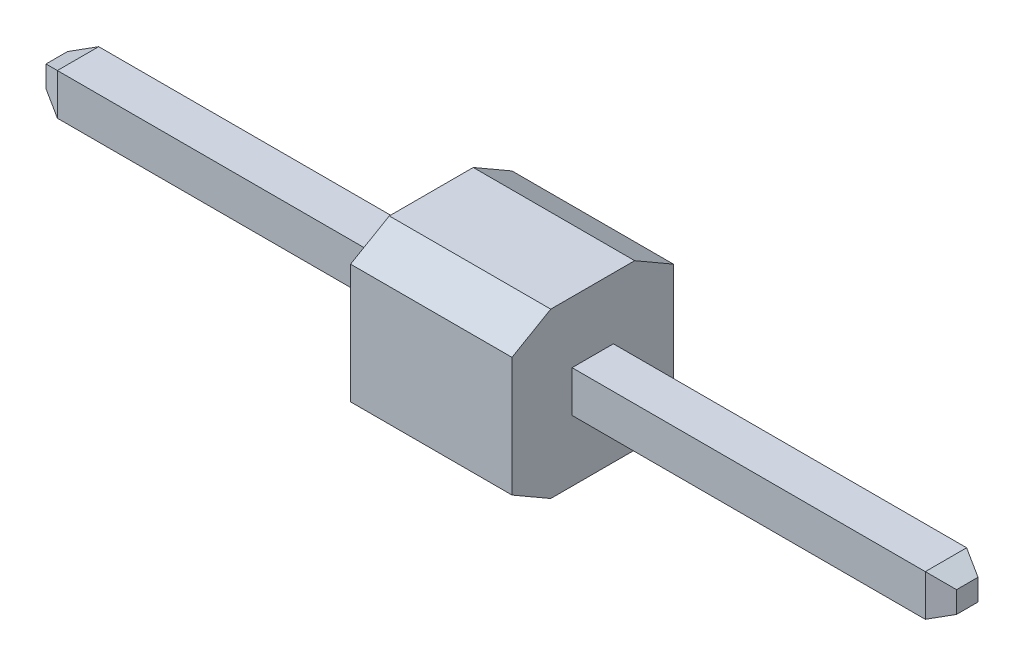
ISO-10303-21;
HEADER;
FILE_DESCRIPTION(('STEP AP214'),'2;1');
FILE_NAME('part.step','',(''),(''),'','','');
FILE_SCHEMA(('AUTOMOTIVE_DESIGN { 1 0 10303 214 1 1 1 1 }'));
ENDSEC;
DATA;
#1=APPLICATION_CONTEXT('core data for automotive mechanical design processes');
#2=APPLICATION_PROTOCOL_DEFINITION('international standard','automotive_design',2000,#1);
#3=PRODUCT_CONTEXT('',#1,'mechanical');
#4=PRODUCT('Part','Part','',(#3));
#5=PRODUCT_RELATED_PRODUCT_CATEGORY('part','',(#4));
#6=PRODUCT_DEFINITION_FORMATION('','',#4);
#7=PRODUCT_DEFINITION_CONTEXT('part definition',#1,'design');
#8=PRODUCT_DEFINITION('design','',#6,#7);
#9=PRODUCT_DEFINITION_SHAPE('','',#8);
#10=(LENGTH_UNIT() NAMED_UNIT(*) SI_UNIT(.MILLI.,.METRE.));
#11=(NAMED_UNIT(*) PLANE_ANGLE_UNIT() SI_UNIT($,.RADIAN.));
#12=(NAMED_UNIT(*) SI_UNIT($,.STERADIAN.) SOLID_ANGLE_UNIT());
#13=UNCERTAINTY_MEASURE_WITH_UNIT(LENGTH_MEASURE(1.E-05),#10,'distance_accuracy_value','');
#14=(GEOMETRIC_REPRESENTATION_CONTEXT(3) GLOBAL_UNCERTAINTY_ASSIGNED_CONTEXT((#13)) GLOBAL_UNIT_ASSIGNED_CONTEXT((#10,
#11,#12)) REPRESENTATION_CONTEXT('',''));
#15=CARTESIAN_POINT('',(0.,0.,0.));
#16=DIRECTION('',(0.,0.,1.));
#17=DIRECTION('',(1.,0.,0.));
#18=AXIS2_PLACEMENT_3D('',#15,#16,#17);
#19=CARTESIAN_POINT('',(5.42105081617534,-15.5571282629139,0.629998634255617));
#20=DIRECTION('',(1.,4.37113882867379E-08,-4.37113882867379E-08));
#21=DIRECTION('',(-4.37113882867379E-08,1.,0.));
#22=AXIS2_PLACEMENT_3D('',#19,#20,#21);
#23=PLANE('',#22);
#24=DIRECTION('',(1.59994777304464E-08,0.500000000000191,0.866025403784328));
#25=VECTOR('',#24,1.);
#26=CARTESIAN_POINT('',(5.42105069318942,-14.3135384244239,-0.940001365744382));
#27=LINE('',#26,#25);
#28=CARTESIAN_POINT('',(5.42105069318942,-14.3135384244239,-0.940001365744382));
#29=VERTEX_POINT('',#28);
#30=CARTESIAN_POINT('',(5.42105070427419,-13.9671282629139,-0.340001365744383));
#31=VERTEX_POINT('',#30);
#32=EDGE_CURVE('E11',#29,#31,#27,.T.);
#33=ORIENTED_EDGE('',*,*,#32,.T.);
#34=DIRECTION('',(4.37113880134522E-08,0.,0.999999999999999));
#35=VECTOR('',#34,1.);
#36=CARTESIAN_POINT('',(5.42105070427419,-13.9671282629139,-0.340001365744383));
#37=LINE('',#36,#35);
#38=CARTESIAN_POINT('',(5.42105076109899,-13.9671282629139,0.959998634255618));
#39=VERTEX_POINT('',#38);
#40=EDGE_CURVE('E304',#31,#39,#37,.T.);
#41=ORIENTED_EDGE('',*,*,#40,.T.);
#42=DIRECTION('',(5.97108681645513E-08,-0.500000000000186,0.866025403784329));
#43=VECTOR('',#42,1.);
#44=CARTESIAN_POINT('',(5.42105076109899,-13.9671282629139,0.959998634255618));
#45=LINE('',#44,#43);
#46=CARTESIAN_POINT('',(5.42105080246789,-14.3135384244239,1.55999863425562));
#47=VERTEX_POINT('',#46);
#48=EDGE_CURVE('E296',#39,#47,#45,.T.);
#49=ORIENTED_EDGE('',*,*,#48,.T.);
#50=DIRECTION('',(4.37113880007249E-08,-0.999999999999999,0.));
#51=VECTOR('',#50,1.);
#52=CARTESIAN_POINT('',(5.42105080246789,-14.3135384244239,1.55999863425562));
#53=LINE('',#52,#51);
#54=CARTESIAN_POINT('',(5.42105088321068,-16.1607181013939,1.55999863425562));
#55=VERTEX_POINT('',#54);
#56=EDGE_CURVE('E281',#47,#55,#53,.T.);
#57=ORIENTED_EDGE('',*,*,#56,.T.);
#58=DIRECTION('',(1.59994790123059E-08,0.500000000000195,0.866025403784326));
#59=VECTOR('',#58,1.);
#60=CARTESIAN_POINT('',(5.42105087212592,-16.5071282629139,0.959998634255618));
#61=LINE('',#60,#59);
#62=CARTESIAN_POINT('',(5.42105087212592,-16.5071282629139,0.959998634255618));
#63=VERTEX_POINT('',#62);
#64=EDGE_CURVE('E265',#63,#55,#61,.T.);
#65=ORIENTED_EDGE('',*,*,#64,.F.);
#66=DIRECTION('',(4.37113880134522E-08,0.,0.999999999999999));
#67=VECTOR('',#66,1.);
#68=CARTESIAN_POINT('',(5.42105081530111,-16.5071282629139,-0.340001365744383));
#69=LINE('',#68,#67);
#70=CARTESIAN_POINT('',(5.42105081530111,-16.5071282629139,-0.340001365744383));
#71=VERTEX_POINT('',#70);
#72=EDGE_CURVE('E248',#71,#63,#69,.T.);
#73=ORIENTED_EDGE('',*,*,#72,.F.);
#74=DIRECTION('',(5.97108668821451E-08,-0.500000000000186,0.866025403784329));
#75=VECTOR('',#74,1.);
#76=CARTESIAN_POINT('',(5.42105077393221,-16.1607181013939,-0.940001365744382));
#77=LINE('',#76,#75);
#78=CARTESIAN_POINT('',(5.42105077393221,-16.1607181013939,-0.940001365744382));
#79=VERTEX_POINT('',#78);
#80=EDGE_CURVE('E242',#79,#71,#77,.T.);
#81=ORIENTED_EDGE('',*,*,#80,.F.);
#82=DIRECTION('',(4.37113880007249E-08,-0.999999999999999,0.));
#83=VECTOR('',#82,1.);
#84=CARTESIAN_POINT('',(5.42105069318942,-14.3135384244239,-0.940001365744382));
#85=LINE('',#84,#83);
#86=EDGE_CURVE('E236',#29,#79,#85,.T.);
#87=ORIENTED_EDGE('',*,*,#86,.F.);
#88=EDGE_LOOP('',(#33,#41,#49,#57,#65,#73,#81,#87));
#89=FACE_BOUND('',#88,.T.);
#90=DIRECTION('',(-4.37113872875372E-08,0.,-0.999999999999999));
#91=VECTOR('',#90,1.);
#92=CARTESIAN_POINT('',(5.42105078820005,-14.9171282629139,0.629998634255617));
#93=LINE('',#92,#91);
#94=CARTESIAN_POINT('',(5.42105078820005,-14.9171282629139,0.629998634255617));
#95=VERTEX_POINT('',#94);
#96=CARTESIAN_POINT('',(5.42105076022476,-14.9171282629139,-0.0100013657443826));
#97=VERTEX_POINT('',#96);
#98=EDGE_CURVE('E302',#95,#97,#93,.T.);
#99=ORIENTED_EDGE('',*,*,#98,.T.);
#100=DIRECTION('',(-4.37113872875371E-08,0.999999999999999,0.));
#101=VECTOR('',#100,1.);
#102=CARTESIAN_POINT('',(5.42105078820005,-15.5571282629139,-0.0100013657443826));
#103=LINE('',#102,#101);
#104=CARTESIAN_POINT('',(5.42105078820005,-15.5571282629139,-0.0100013657443826));
#105=VERTEX_POINT('',#104);
#106=EDGE_CURVE('E293',#105,#97,#103,.T.);
#107=ORIENTED_EDGE('',*,*,#106,.F.);
#108=DIRECTION('',(-4.37113886753159E-08,0.,-0.999999999999999));
#109=VECTOR('',#108,1.);
#110=CARTESIAN_POINT('',(5.42105081617534,-15.5571282629139,0.629998634255617));
#111=LINE('',#110,#109);
#112=CARTESIAN_POINT('',(5.42105081617534,-15.5571282629139,0.629998634255617));
#113=VERTEX_POINT('',#112);
#114=EDGE_CURVE('E278',#113,#105,#111,.T.);
#115=ORIENTED_EDGE('',*,*,#114,.F.);
#116=DIRECTION('',(-4.37113886753159E-08,0.999999999999999,0.));
#117=VECTOR('',#116,1.);
#118=CARTESIAN_POINT('',(5.42105081617534,-15.5571282629139,0.629998634255617));
#119=LINE('',#118,#117);
#120=EDGE_CURVE('E263',#113,#95,#119,.T.);
#121=ORIENTED_EDGE('',*,*,#120,.T.);
#122=EDGE_LOOP('',(#99,#107,#115,#121));
#123=FACE_BOUND('',#122,.T.);
#124=ADVANCED_FACE('F17',(#89,#123),#23,.T.);
#125=CARTESIAN_POINT('',(2.92105081617534,-15.5571283721924,0.629998743534088));
#126=DIRECTION('',(1.,4.37113882867379E-08,-4.37113882867379E-08));
#127=DIRECTION('',(-4.37113882867379E-08,1.,0.));
#128=AXIS2_PLACEMENT_3D('',#125,#126,#127);
#129=PLANE('',#128);
#130=DIRECTION('',(1.59994783714339E-08,0.500000000000191,0.866025403784328));
#131=VECTOR('',#130,1.);
#132=CARTESIAN_POINT('',(2.92105069318942,-14.3135385337024,-0.940001256465912));
#133=LINE('',#132,#131);
#134=CARTESIAN_POINT('',(2.92105069318942,-14.3135385337024,-0.940001256465912));
#135=VERTEX_POINT('',#134);
#136=CARTESIAN_POINT('',(2.92105070427419,-13.9671283721924,-0.340001256465912));
#137=VERTEX_POINT('',#136);
#138=EDGE_CURVE('E24',#135,#137,#133,.T.);
#139=ORIENTED_EDGE('',*,*,#138,.F.);
#140=DIRECTION('',(4.37113882411396E-08,-0.999999999999999,0.));
#141=VECTOR('',#140,1.);
#142=CARTESIAN_POINT('',(2.92105069318942,-14.3135385337024,-0.940001256465912));
#143=LINE('',#142,#141);
#144=CARTESIAN_POINT('',(2.92105077393221,-16.1607182106724,-0.940001256465912));
#145=VERTEX_POINT('',#144);
#146=EDGE_CURVE('E300',#135,#145,#143,.T.);
#147=ORIENTED_EDGE('',*,*,#146,.T.);
#148=DIRECTION('',(5.97108668821451E-08,-0.500000000000186,0.866025403784329));
#149=VECTOR('',#148,1.);
#150=CARTESIAN_POINT('',(2.92105077393221,-16.1607182106724,-0.940001256465912));
#151=LINE('',#150,#149);
#152=CARTESIAN_POINT('',(2.92105081530111,-16.5071283721924,-0.340001256465912));
#153=VERTEX_POINT('',#152);
#154=EDGE_CURVE('E286',#145,#153,#151,.T.);
#155=ORIENTED_EDGE('',*,*,#154,.T.);
#156=DIRECTION('',(4.37113883550593E-08,0.,0.999999999999999));
#157=VECTOR('',#156,1.);
#158=CARTESIAN_POINT('',(2.92105081530111,-16.5071283721924,-0.340001256465912));
#159=LINE('',#158,#157);
#160=CARTESIAN_POINT('',(2.92105087212592,-16.5071283721924,0.959998743534088));
#161=VERTEX_POINT('',#160);
#162=EDGE_CURVE('E271',#153,#161,#159,.T.);
#163=ORIENTED_EDGE('',*,*,#162,.T.);
#164=DIRECTION('',(1.59994783713184E-08,0.500000000000195,0.866025403784326));
#165=VECTOR('',#164,1.);
#166=CARTESIAN_POINT('',(2.92105087212592,-16.5071283721924,0.959998743534088));
#167=LINE('',#166,#165);
#168=CARTESIAN_POINT('',(2.92105088321068,-16.1607182106724,1.55999874353409));
#169=VERTEX_POINT('',#168);
#170=EDGE_CURVE('E253',#161,#169,#167,.T.);
#171=ORIENTED_EDGE('',*,*,#170,.T.);
#172=DIRECTION('',(4.37113882411396E-08,-0.999999999999999,0.));
#173=VECTOR('',#172,1.);
#174=CARTESIAN_POINT('',(2.92105080246789,-14.3135385337024,1.55999874353409));
#175=LINE('',#174,#173);
#176=CARTESIAN_POINT('',(2.92105080246789,-14.3135385337024,1.55999874353409));
#177=VERTEX_POINT('',#176);
#178=EDGE_CURVE('E261',#177,#169,#175,.T.);
#179=ORIENTED_EDGE('',*,*,#178,.F.);
#180=DIRECTION('',(5.97108668825762E-08,-0.500000000000186,0.866025403784329));
#181=VECTOR('',#180,1.);
#182=CARTESIAN_POINT('',(2.92105076109899,-13.9671283721924,0.959998743534088));
#183=LINE('',#182,#181);
#184=CARTESIAN_POINT('',(2.92105076109899,-13.9671283721924,0.959998743534088));
#185=VERTEX_POINT('',#184);
#186=EDGE_CURVE('E276',#185,#177,#183,.T.);
#187=ORIENTED_EDGE('',*,*,#186,.F.);
#188=DIRECTION('',(4.37113883550593E-08,0.,0.999999999999999));
#189=VECTOR('',#188,1.);
#190=CARTESIAN_POINT('',(2.92105070427419,-13.9671283721924,-0.340001256465912));
#191=LINE('',#190,#189);
#192=EDGE_CURVE('E291',#137,#185,#191,.T.);
#193=ORIENTED_EDGE('',*,*,#192,.F.);
#194=EDGE_LOOP('',(#139,#147,#155,#163,#171,#179,#187,#193));
#195=FACE_BOUND('',#194,.T.);
#196=DIRECTION('',(-4.37113886753159E-08,0.999999999999999,0.));
#197=VECTOR('',#196,1.);
#198=CARTESIAN_POINT('',(2.92105078820005,-15.5571283721924,-0.0100012564659119));
#199=LINE('',#198,#197);
#200=CARTESIAN_POINT('',(2.92105078820005,-15.5571283721924,-0.0100012564659119));
#201=VERTEX_POINT('',#200);
#202=CARTESIAN_POINT('',(2.92105076022476,-14.9171283721924,-0.0100012564659119));
#203=VERTEX_POINT('',#202);
#204=EDGE_CURVE('E298',#201,#203,#199,.T.);
#205=ORIENTED_EDGE('',*,*,#204,.T.);
#206=DIRECTION('',(-4.37113886753159E-08,0.,-0.999999999999999));
#207=VECTOR('',#206,1.);
#208=CARTESIAN_POINT('',(2.92105078820005,-14.9171283721924,0.629998743534088));
#209=LINE('',#208,#207);
#210=CARTESIAN_POINT('',(2.92105078820005,-14.9171283721924,0.629998743534088));
#211=VERTEX_POINT('',#210);
#212=EDGE_CURVE('E283',#211,#203,#209,.T.);
#213=ORIENTED_EDGE('',*,*,#212,.F.);
#214=DIRECTION('',(-4.37113879814265E-08,0.999999999999999,0.));
#215=VECTOR('',#214,1.);
#216=CARTESIAN_POINT('',(2.92105081617534,-15.5571283721924,0.629998743534088));
#217=LINE('',#216,#215);
#218=CARTESIAN_POINT('',(2.92105081617534,-15.5571283721924,0.629998743534088));
#219=VERTEX_POINT('',#218);
#220=EDGE_CURVE('E268',#219,#211,#217,.T.);
#221=ORIENTED_EDGE('',*,*,#220,.F.);
#222=DIRECTION('',(-4.37113879814266E-08,0.,-0.999999999999999));
#223=VECTOR('',#222,1.);
#224=CARTESIAN_POINT('',(2.92105081617534,-15.5571283721924,0.629998743534088));
#225=LINE('',#224,#223);
#226=EDGE_CURVE('E251',#219,#201,#225,.T.);
#227=ORIENTED_EDGE('',*,*,#226,.T.);
#228=EDGE_LOOP('',(#205,#213,#221,#227));
#229=FACE_BOUND('',#228,.T.);
#230=ADVANCED_FACE('F314',(#195,#229),#129,.F.);
#231=CARTESIAN_POINT('',(5.42105069318942,-14.3135384244239,-0.940001365744382));
#232=DIRECTION('',(5.97108668343731E-08,-0.866025403784328,0.50000000000019));
#233=DIRECTION('',(-1.59994785476185E-08,-0.500000000000192,-0.866025403784329));
#234=AXIS2_PLACEMENT_3D('',#231,#232,#233);
#235=PLANE('',#234);
#236=ORIENTED_EDGE('',*,*,#138,.T.);
#237=DIRECTION('',(-0.999999999999998,-4.37113854445669E-08,4.37113883755557E-08));
#238=VECTOR('',#237,1.);
#239=CARTESIAN_POINT('',(5.42105070427419,-13.9671282629139,-0.340001365744383));
#240=LINE('',#239,#238);
#241=EDGE_CURVE('E288',#31,#137,#240,.T.);
#242=ORIENTED_EDGE('',*,*,#241,.F.);
#243=ORIENTED_EDGE('',*,*,#32,.F.);
#244=DIRECTION('',(-0.999999999999998,-4.37113897078233E-08,4.37113881091021E-08));
#245=VECTOR('',#244,1.);
#246=CARTESIAN_POINT('',(5.42105069318942,-14.3135384244239,-0.940001365744382));
#247=LINE('',#246,#245);
#248=EDGE_CURVE('E256',#29,#135,#247,.T.);
#249=ORIENTED_EDGE('',*,*,#248,.T.);
#250=EDGE_LOOP('',(#236,#242,#243,#249));
#251=FACE_BOUND('',#250,.T.);
#252=ADVANCED_FACE('F306',(#251),#235,.F.);
#253=CARTESIAN_POINT('',(5.42105070427419,-13.9671282629139,-0.340001365744383));
#254=DIRECTION('',(4.37113882867379E-08,-1.,0.));
#255=DIRECTION('',(1.,4.37113882867379E-08,-4.37113882867379E-08));
#256=AXIS2_PLACEMENT_3D('',#253,#254,#255);
#257=PLANE('',#256);
#258=ORIENTED_EDGE('',*,*,#192,.T.);
#259=DIRECTION('',(-0.999999999999998,-4.37113854445669E-08,4.37113882867378E-08));
#260=VECTOR('',#259,1.);
#261=CARTESIAN_POINT('',(5.42105076109899,-13.9671282629139,0.959998634255618));
#262=LINE('',#261,#260);
#263=EDGE_CURVE('E273',#39,#185,#262,.T.);
#264=ORIENTED_EDGE('',*,*,#263,.F.);
#265=ORIENTED_EDGE('',*,*,#40,.F.);
#266=ORIENTED_EDGE('',*,*,#241,.T.);
#267=EDGE_LOOP('',(#258,#264,#265,#266));
#268=FACE_BOUND('',#267,.T.);
#269=ADVANCED_FACE('F311',(#268),#257,.F.);
#270=CARTESIAN_POINT('',(5.42105076109899,-13.9671282629139,0.959998634255618));
#271=DIRECTION('',(1.59994785476185E-08,-0.86602540378433,-0.50000000000019));
#272=DIRECTION('',(-5.97108668343731E-08,0.500000000000188,-0.866025403784329));
#273=AXIS2_PLACEMENT_3D('',#270,#271,#272);
#274=PLANE('',#273);
#275=ORIENTED_EDGE('',*,*,#186,.T.);
#276=DIRECTION('',(-0.999999999999998,-4.37113897078233E-08,4.37113882867378E-08));
#277=VECTOR('',#276,1.);
#278=CARTESIAN_POINT('',(5.42105080246789,-14.3135384244239,1.55999863425562));
#279=LINE('',#278,#277);
#280=EDGE_CURVE('E258',#47,#177,#279,.T.);
#281=ORIENTED_EDGE('',*,*,#280,.F.);
#282=ORIENTED_EDGE('',*,*,#48,.F.);
#283=ORIENTED_EDGE('',*,*,#263,.T.);
#284=EDGE_LOOP('',(#275,#281,#282,#283));
#285=FACE_BOUND('',#284,.T.);
#286=ADVANCED_FACE('F319',(#285),#274,.F.);
#287=CARTESIAN_POINT('',(5.42105080246789,-14.3135384244239,1.55999863425562));
#288=DIRECTION('',(-4.37113882867379E-08,0.,-1.));
#289=DIRECTION('',(-1.,-4.37113882867379E-08,4.37113882867379E-08));
#290=AXIS2_PLACEMENT_3D('',#287,#288,#289);
#291=PLANE('',#290);
#292=ORIENTED_EDGE('',*,*,#178,.T.);
#293=DIRECTION('',(-0.999999999999998,-4.37113897078233E-08,4.37113882867378E-08));
#294=VECTOR('',#293,1.);
#295=CARTESIAN_POINT('',(5.42105088321068,-16.1607181013939,1.55999863425562));
#296=LINE('',#295,#294);
#297=EDGE_CURVE('E245',#55,#169,#296,.T.);
#298=ORIENTED_EDGE('',*,*,#297,.F.);
#299=ORIENTED_EDGE('',*,*,#56,.F.);
#300=ORIENTED_EDGE('',*,*,#280,.T.);
#301=EDGE_LOOP('',(#292,#298,#299,#300));
#302=FACE_BOUND('',#301,.T.);
#303=ADVANCED_FACE('F326',(#302),#291,.F.);
#304=CARTESIAN_POINT('',(5.42105087212592,-16.5071282629139,0.959998634255618));
#305=DIRECTION('',(5.97108668343731E-08,-0.866025403784328,0.50000000000019));
#306=DIRECTION('',(-1.59994785476185E-08,-0.500000000000192,-0.866025403784329));
#307=AXIS2_PLACEMENT_3D('',#304,#305,#306);
#308=PLANE('',#307);
#309=ORIENTED_EDGE('',*,*,#170,.F.);
#310=DIRECTION('',(-0.999999999999998,-4.37113854445669E-08,4.37113882867378E-08));
#311=VECTOR('',#310,1.);
#312=CARTESIAN_POINT('',(5.42105087212592,-16.5071282629139,0.959998634255618));
#313=LINE('',#312,#311);
#314=EDGE_CURVE('E239',#63,#161,#313,.T.);
#315=ORIENTED_EDGE('',*,*,#314,.F.);
#316=ORIENTED_EDGE('',*,*,#64,.T.);
#317=ORIENTED_EDGE('',*,*,#297,.T.);
#318=EDGE_LOOP('',(#309,#315,#316,#317));
#319=FACE_BOUND('',#318,.T.);
#320=ADVANCED_FACE('F329',(#319),#308,.T.);
#321=CARTESIAN_POINT('',(5.42105081530111,-16.5071282629139,-0.340001365744383));
#322=DIRECTION('',(4.37113882867379E-08,-1.,0.));
#323=DIRECTION('',(1.,4.37113882867379E-08,-4.37113882867379E-08));
#324=AXIS2_PLACEMENT_3D('',#321,#322,#323);
#325=PLANE('',#324);
#326=ORIENTED_EDGE('',*,*,#162,.F.);
#327=DIRECTION('',(-0.999999999999998,-4.37113854445669E-08,4.37113883755557E-08));
#328=VECTOR('',#327,1.);
#329=CARTESIAN_POINT('',(5.42105081530111,-16.5071282629139,-0.340001365744383));
#330=LINE('',#329,#328);
#331=EDGE_CURVE('E233',#71,#153,#330,.T.);
#332=ORIENTED_EDGE('',*,*,#331,.F.);
#333=ORIENTED_EDGE('',*,*,#72,.T.);
#334=ORIENTED_EDGE('',*,*,#314,.T.);
#335=EDGE_LOOP('',(#326,#332,#333,#334));
#336=FACE_BOUND('',#335,.T.);
#337=ADVANCED_FACE('F333',(#336),#325,.T.);
#338=CARTESIAN_POINT('',(5.42105077393221,-16.1607181013939,-0.940001365744382));
#339=DIRECTION('',(1.59994785476185E-08,-0.86602540378433,-0.50000000000019));
#340=DIRECTION('',(-5.97108668343731E-08,0.500000000000188,-0.866025403784329));
#341=AXIS2_PLACEMENT_3D('',#338,#339,#340);
#342=PLANE('',#341);
#343=ORIENTED_EDGE('',*,*,#154,.F.);
#344=DIRECTION('',(-0.999999999999998,-4.37113897078233E-08,4.37113881091022E-08));
#345=VECTOR('',#344,1.);
#346=CARTESIAN_POINT('',(5.42105077393221,-16.1607181013939,-0.940001365744382));
#347=LINE('',#346,#345);
#348=EDGE_CURVE('E230',#79,#145,#347,.T.);
#349=ORIENTED_EDGE('',*,*,#348,.F.);
#350=ORIENTED_EDGE('',*,*,#80,.T.);
#351=ORIENTED_EDGE('',*,*,#331,.T.);
#352=EDGE_LOOP('',(#343,#349,#350,#351));
#353=FACE_BOUND('',#352,.T.);
#354=ADVANCED_FACE('F337',(#353),#342,.T.);
#355=CARTESIAN_POINT('',(5.42105069318942,-14.3135384244239,-0.940001365744382));
#356=DIRECTION('',(-4.37113882867379E-08,0.,-1.));
#357=DIRECTION('',(-4.37113882867379E-08,1.,0.));
#358=AXIS2_PLACEMENT_3D('',#355,#356,#357);
#359=PLANE('',#358);
#360=ORIENTED_EDGE('',*,*,#146,.F.);
#361=ORIENTED_EDGE('',*,*,#248,.F.);
#362=ORIENTED_EDGE('',*,*,#86,.T.);
#363=ORIENTED_EDGE('',*,*,#348,.T.);
#364=EDGE_LOOP('',(#360,#361,#362,#363));
#365=FACE_BOUND('',#364,.T.);
#366=ADVANCED_FACE('F339',(#365),#359,.T.);
#367=CARTESIAN_POINT('',(-2.87894918382466,-15.5571286257184,0.62999899706014));
#368=DIRECTION('',(-1.,-4.37113882867379E-08,4.37113882867379E-08));
#369=DIRECTION('',(4.37113882867379E-08,-1.,0.));
#370=AXIS2_PLACEMENT_3D('',#367,#368,#369);
#371=PLANE('',#370);
#372=DIRECTION('',(4.3711384729096E-08,-0.999999999999999,0.));
#373=VECTOR('',#372,1.);
#374=CARTESIAN_POINT('',(-2.87894922632249,-15.0710101529084,0.14388052425114));
#375=LINE('',#374,#373);
#376=CARTESIAN_POINT('',(-2.87894922632249,-15.0710101529084,0.14388052425114));
#377=VERTEX_POINT('',#376);
#378=CARTESIAN_POINT('',(-2.87894921179995,-15.4032470985184,0.14388052425114));
#379=VERTEX_POINT('',#378);
#380=EDGE_CURVE('E228',#377,#379,#375,.T.);
#381=ORIENTED_EDGE('',*,*,#380,.T.);
#382=DIRECTION('',(4.37113900746999E-08,0.,0.999999999999999));
#383=VECTOR('',#382,1.);
#384=CARTESIAN_POINT('',(-2.87894921179995,-15.4032470985184,0.14388052425114));
#385=LINE('',#384,#383);
#386=CARTESIAN_POINT('',(-2.87894919727741,-15.4032470985184,0.47611746986914));
#387=VERTEX_POINT('',#386);
#388=EDGE_CURVE('E223',#379,#387,#385,.T.);
#389=ORIENTED_EDGE('',*,*,#388,.T.);
#390=DIRECTION('',(-4.37113874024243E-08,0.999999999999999,0.));
#391=VECTOR('',#390,1.);
#392=CARTESIAN_POINT('',(-2.87894919727741,-15.4032470985184,0.47611746986914));
#393=LINE('',#392,#391);
#394=CARTESIAN_POINT('',(-2.87894921179995,-15.0710101529084,0.47611746986914));
#395=VERTEX_POINT('',#394);
#396=EDGE_CURVE('E215',#387,#395,#393,.T.);
#397=ORIENTED_EDGE('',*,*,#396,.T.);
#398=DIRECTION('',(-4.37113820547151E-08,0.,-0.999999999999999));
#399=VECTOR('',#398,1.);
#400=CARTESIAN_POINT('',(-2.87894921179995,-15.0710101529084,0.47611746986914));
#401=LINE('',#400,#399);
#402=EDGE_CURVE('E207',#395,#377,#401,.T.);
#403=ORIENTED_EDGE('',*,*,#402,.T.);
#404=EDGE_LOOP('',(#381,#389,#397,#403));
#405=FACE_BOUND('',#404,.T.);
#406=ADVANCED_FACE('F341',(#405),#371,.T.);
#407=CARTESIAN_POINT('',(-2.87894918382466,-15.5571286257184,0.62999899706014));
#408=DIRECTION('',(4.37113882867379E-08,-1.,0.));
#409=DIRECTION('',(-4.37113882867379E-08,0.,-1.));
#410=AXIS2_PLACEMENT_3D('',#407,#408,#409);
#411=PLANE('',#410);
#412=DIRECTION('',(0.999999999999998,4.37113888452998E-08,-4.37113882769955E-08));
#413=VECTOR('',#412,1.);
#414=CARTESIAN_POINT('',(-2.54894918382466,-15.5571286112937,0.629998982635382));
#415=LINE('',#414,#413);
#416=CARTESIAN_POINT('',(-2.54894918382466,-15.5571286112937,0.629998982635382));
#417=VERTEX_POINT('',#416);
#418=EDGE_CURVE('E225',#417,#219,#415,.T.);
#419=ORIENTED_EDGE('',*,*,#418,.F.);
#420=DIRECTION('',(-4.37113886753159E-08,0.,-0.999999999999999));
#421=VECTOR('',#420,1.);
#422=CARTESIAN_POINT('',(-2.54894918382466,-15.5571286112937,0.629998982635382));
#423=LINE('',#422,#421);
#424=CARTESIAN_POINT('',(-2.54894921179995,-15.5571286112937,-0.010001017364618));
#425=VERTEX_POINT('',#424);
#426=EDGE_CURVE('E217',#417,#425,#423,.T.);
#427=ORIENTED_EDGE('',*,*,#426,.T.);
#428=DIRECTION('',(0.999999999999998,4.37113888452998E-08,-4.37113882161057E-08));
#429=VECTOR('',#428,1.);
#430=CARTESIAN_POINT('',(-2.54894921179995,-15.5571286112937,-0.010001017364618));
#431=LINE('',#430,#429);
#432=EDGE_CURVE('E220',#425,#201,#431,.T.);
#433=ORIENTED_EDGE('',*,*,#432,.T.);
#434=ORIENTED_EDGE('',*,*,#226,.F.);
#435=EDGE_LOOP('',(#419,#427,#433,#434));
#436=FACE_BOUND('',#435,.T.);
#437=ADVANCED_FACE('F348',(#436),#411,.T.);
#438=CARTESIAN_POINT('',(-2.87894921179995,-15.5571286257184,-0.0100010029398598));
#439=DIRECTION('',(-4.37113882867379E-08,0.,-1.));
#440=DIRECTION('',(-1.,-4.37113882867379E-08,4.37113882867379E-08));
#441=AXIS2_PLACEMENT_3D('',#438,#439,#440);
#442=PLANE('',#441);
#443=ORIENTED_EDGE('',*,*,#432,.F.);
#444=DIRECTION('',(-4.37113872875371E-08,0.999999999999999,0.));
#445=VECTOR('',#444,1.);
#446=CARTESIAN_POINT('',(-2.54894921179995,-15.5571286112937,-0.010001017364618));
#447=LINE('',#446,#445);
#448=CARTESIAN_POINT('',(-2.54894923977524,-14.9171286112937,-0.010001017364618));
#449=VERTEX_POINT('',#448);
#450=EDGE_CURVE('E209',#425,#449,#447,.T.);
#451=ORIENTED_EDGE('',*,*,#450,.T.);
#452=DIRECTION('',(0.999999999999998,4.37113855978467E-08,-4.37113882161058E-08));
#453=VECTOR('',#452,1.);
#454=CARTESIAN_POINT('',(-2.54894923977524,-14.9171286112937,-0.010001017364618));
#455=LINE('',#454,#453);
#456=EDGE_CURVE('E212',#449,#203,#455,.T.);
#457=ORIENTED_EDGE('',*,*,#456,.T.);
#458=ORIENTED_EDGE('',*,*,#204,.F.);
#459=EDGE_LOOP('',(#443,#451,#457,#458));
#460=FACE_BOUND('',#459,.T.);
#461=ADVANCED_FACE('F424',(#460),#442,.T.);
#462=CARTESIAN_POINT('',(-2.87894921179995,-14.9171286257184,0.62999899706014));
#463=DIRECTION('',(4.37113882867379E-08,-1.,0.));
#464=DIRECTION('',(-4.37113882867379E-08,0.,-1.));
#465=AXIS2_PLACEMENT_3D('',#462,#463,#464);
#466=PLANE('',#465);
#467=ORIENTED_EDGE('',*,*,#456,.F.);
#468=DIRECTION('',(4.37113886753159E-08,0.,0.999999999999999));
#469=VECTOR('',#468,1.);
#470=CARTESIAN_POINT('',(-2.54894923977524,-14.9171286112937,-0.010001017364618));
#471=LINE('',#470,#469);
#472=CARTESIAN_POINT('',(-2.54894921179995,-14.9171286112937,0.629998982635382));
#473=VERTEX_POINT('',#472);
#474=EDGE_CURVE('E201',#449,#473,#471,.T.);
#475=ORIENTED_EDGE('',*,*,#474,.T.);
#476=DIRECTION('',(0.999999999999998,4.37113855978467E-08,-4.37113882769955E-08));
#477=VECTOR('',#476,1.);
#478=CARTESIAN_POINT('',(-2.54894921179995,-14.9171286112937,0.629998982635382));
#479=LINE('',#478,#477);
#480=EDGE_CURVE('E204',#473,#211,#479,.T.);
#481=ORIENTED_EDGE('',*,*,#480,.T.);
#482=ORIENTED_EDGE('',*,*,#212,.T.);
#483=EDGE_LOOP('',(#467,#475,#481,#482));
#484=FACE_BOUND('',#483,.T.);
#485=ADVANCED_FACE('F421',(#484),#466,.F.);
#486=CARTESIAN_POINT('',(-2.87894918382466,-15.5571286257184,0.62999899706014));
#487=DIRECTION('',(-4.37113882867379E-08,0.,-1.));
#488=DIRECTION('',(-1.,-4.37113882867379E-08,4.37113882867379E-08));
#489=AXIS2_PLACEMENT_3D('',#486,#487,#488);
#490=PLANE('',#489);
#491=ORIENTED_EDGE('',*,*,#480,.F.);
#492=DIRECTION('',(4.37113872875371E-08,-0.999999999999999,0.));
#493=VECTOR('',#492,1.);
#494=CARTESIAN_POINT('',(-2.54894921179995,-14.9171286112937,0.629998982635382));
#495=LINE('',#494,#493);
#496=EDGE_CURVE('E196',#473,#417,#495,.T.);
#497=ORIENTED_EDGE('',*,*,#496,.T.);
#498=ORIENTED_EDGE('',*,*,#418,.T.);
#499=ORIENTED_EDGE('',*,*,#220,.T.);
#500=EDGE_LOOP('',(#491,#497,#498,#499));
#501=FACE_BOUND('',#500,.T.);
#502=ADVANCED_FACE('F376',(#501),#490,.F.);
#503=CARTESIAN_POINT('',(-2.87894918382466,-15.5571286257184,0.62999899706014));
#504=DIRECTION('',(-4.37113882867379E-08,0.,-1.));
#505=DIRECTION('',(-1.,-4.37113882867379E-08,4.37113882867379E-08));
#506=AXIS2_PLACEMENT_3D('',#503,#504,#505);
#507=PLANE('',#506);
#508=DIRECTION('',(0.999999999999998,4.37113829998842E-08,-4.37113882769955E-08));
#509=VECTOR('',#508,1.);
#510=CARTESIAN_POINT('',(5.42105081617534,-15.5571282629139,0.629998634255617));
#511=LINE('',#510,#509);
#512=CARTESIAN_POINT('',(10.8910508161753,-15.5571280238126,0.629998395154324));
#513=VERTEX_POINT('',#512);
#514=EDGE_CURVE('E199',#113,#513,#511,.T.);
#515=ORIENTED_EDGE('',*,*,#514,.T.);
#516=DIRECTION('',(-4.37113900630947E-08,0.999999999999999,0.));
#517=VECTOR('',#516,1.);
#518=CARTESIAN_POINT('',(10.8910508161753,-15.5571280238126,0.629998395154324));
#519=LINE('',#518,#517);
#520=CARTESIAN_POINT('',(10.8910507882001,-14.9171280238126,0.629998395154324));
#521=VERTEX_POINT('',#520);
#522=EDGE_CURVE('E191',#513,#521,#519,.T.);
#523=ORIENTED_EDGE('',*,*,#522,.T.);
#524=DIRECTION('',(0.999999999999998,4.37113881958092E-08,-4.37113882769955E-08));
#525=VECTOR('',#524,1.);
#526=CARTESIAN_POINT('',(5.42105078820005,-14.9171282629139,0.629998634255617));
#527=LINE('',#526,#525);
#528=EDGE_CURVE('E194',#95,#521,#527,.T.);
#529=ORIENTED_EDGE('',*,*,#528,.F.);
#530=ORIENTED_EDGE('',*,*,#120,.F.);
#531=EDGE_LOOP('',(#515,#523,#529,#530));
#532=FACE_BOUND('',#531,.T.);
#533=ADVANCED_FACE('F367',(#532),#507,.F.);
#534=CARTESIAN_POINT('',(-2.87894921179995,-14.9171286257184,0.62999899706014));
#535=DIRECTION('',(4.37113882867379E-08,-1.,0.));
#536=DIRECTION('',(-4.37113882867379E-08,0.,-1.));
#537=AXIS2_PLACEMENT_3D('',#534,#535,#536);
#538=PLANE('',#537);
#539=ORIENTED_EDGE('',*,*,#528,.T.);
#540=DIRECTION('',(-4.37113900630947E-08,0.,-0.999999999999999));
#541=VECTOR('',#540,1.);
#542=CARTESIAN_POINT('',(10.8910507882001,-14.9171280238126,0.629998395154324));
#543=LINE('',#542,#541);
#544=CARTESIAN_POINT('',(10.8910507602248,-14.9171280238126,-0.0100016048456765));
#545=VERTEX_POINT('',#544);
#546=EDGE_CURVE('E186',#521,#545,#543,.T.);
#547=ORIENTED_EDGE('',*,*,#546,.T.);
#548=DIRECTION('',(0.999999999999998,4.37113881958092E-08,-4.37113881146228E-08));
#549=VECTOR('',#548,1.);
#550=CARTESIAN_POINT('',(5.42105076022476,-14.9171282629139,-0.0100013657443823));
#551=LINE('',#550,#549);
#552=EDGE_CURVE('E189',#97,#545,#551,.T.);
#553=ORIENTED_EDGE('',*,*,#552,.F.);
#554=ORIENTED_EDGE('',*,*,#98,.F.);
#555=EDGE_LOOP('',(#539,#547,#553,#554));
#556=FACE_BOUND('',#555,.T.);
#557=ADVANCED_FACE('F364',(#556),#538,.F.);
#558=CARTESIAN_POINT('',(-2.87894921179995,-15.5571286257184,-0.0100010029398598));
#559=DIRECTION('',(-4.37113882867379E-08,0.,-1.));
#560=DIRECTION('',(-1.,-4.37113882867379E-08,4.37113882867379E-08));
#561=AXIS2_PLACEMENT_3D('',#558,#559,#560);
#562=PLANE('',#561);
#563=ORIENTED_EDGE('',*,*,#552,.T.);
#564=DIRECTION('',(4.37113900630947E-08,-0.999999999999999,0.));
#565=VECTOR('',#564,1.);
#566=CARTESIAN_POINT('',(10.8910507602248,-14.9171280238126,-0.0100016048456764));
#567=LINE('',#566,#565);
#568=CARTESIAN_POINT('',(10.8910507882001,-15.5571280238126,-0.0100016048456765));
#569=VERTEX_POINT('',#568);
#570=EDGE_CURVE('E176',#545,#569,#567,.T.);
#571=ORIENTED_EDGE('',*,*,#570,.T.);
#572=DIRECTION('',(0.999999999999998,4.37113829998842E-08,-4.37113881146228E-08));
#573=VECTOR('',#572,1.);
#574=CARTESIAN_POINT('',(5.42105078820005,-15.5571282629139,-0.0100013657443823));
#575=LINE('',#574,#573);
#576=EDGE_CURVE('E179',#105,#569,#575,.T.);
#577=ORIENTED_EDGE('',*,*,#576,.F.);
#578=ORIENTED_EDGE('',*,*,#106,.T.);
#579=EDGE_LOOP('',(#563,#571,#577,#578));
#580=FACE_BOUND('',#579,.T.);
#581=ADVANCED_FACE('F366',(#580),#562,.T.);
#582=CARTESIAN_POINT('',(-2.87894918382466,-15.5571286257184,0.62999899706014));
#583=DIRECTION('',(4.37113882867379E-08,-1.,0.));
#584=DIRECTION('',(-4.37113882867379E-08,0.,-1.));
#585=AXIS2_PLACEMENT_3D('',#582,#583,#584);
#586=PLANE('',#585);
#587=ORIENTED_EDGE('',*,*,#576,.T.);
#588=DIRECTION('',(4.37113872875372E-08,0.,0.999999999999999));
#589=VECTOR('',#588,1.);
#590=CARTESIAN_POINT('',(10.8910507882001,-15.5571280238126,-0.0100016048456765));
#591=LINE('',#590,#589);
#592=EDGE_CURVE('E167',#569,#513,#591,.T.);
#593=ORIENTED_EDGE('',*,*,#592,.T.);
#594=ORIENTED_EDGE('',*,*,#514,.F.);
#595=ORIENTED_EDGE('',*,*,#114,.T.);
#596=EDGE_LOOP('',(#587,#593,#594,#595));
#597=FACE_BOUND('',#596,.T.);
#598=ADVANCED_FACE('F373',(#597),#586,.T.);
#599=CARTESIAN_POINT('',(11.2210508161753,-15.5571280093879,0.629998380729565));
#600=DIRECTION('',(-1.,-4.37113882867379E-08,4.37113882867379E-08));
#601=DIRECTION('',(4.37113882867379E-08,-1.,0.));
#602=AXIS2_PLACEMENT_3D('',#599,#600,#601);
#603=PLANE('',#602);
#604=DIRECTION('',(-4.37113874024243E-08,0.999999999999999,0.));
#605=VECTOR('',#604,1.);
#606=CARTESIAN_POINT('',(11.2210507882001,-15.4032464821879,0.143879907920565));
#607=LINE('',#606,#605);
#608=CARTESIAN_POINT('',(11.2210507882001,-15.4032464821879,0.143879907920565));
#609=VERTEX_POINT('',#608);
#610=CARTESIAN_POINT('',(11.2210507736775,-15.0710095365779,0.143879907920565));
#611=VERTEX_POINT('',#610);
#612=EDGE_CURVE('E153',#609,#611,#607,.T.);
#613=ORIENTED_EDGE('',*,*,#612,.T.);
#614=DIRECTION('',(4.37113874013716E-08,0.,0.999999999999999));
#615=VECTOR('',#614,1.);
#616=CARTESIAN_POINT('',(11.2210507736775,-15.0710095365779,0.143879907920565));
#617=LINE('',#616,#615);
#618=CARTESIAN_POINT('',(11.2210507882001,-15.0710095365779,0.476116853538565));
#619=VERTEX_POINT('',#618);
#620=EDGE_CURVE('E395',#611,#619,#617,.T.);
#621=ORIENTED_EDGE('',*,*,#620,.T.);
#622=DIRECTION('',(4.37113874024243E-08,-0.999999999999999,0.));
#623=VECTOR('',#622,1.);
#624=CARTESIAN_POINT('',(11.2210507882001,-15.0710095365779,0.476116853538565));
#625=LINE('',#624,#623);
#626=CARTESIAN_POINT('',(11.2210508027226,-15.4032464821879,0.476116853538565));
#627=VERTEX_POINT('',#626);
#628=EDGE_CURVE('E156',#619,#627,#625,.T.);
#629=ORIENTED_EDGE('',*,*,#628,.T.);
#630=DIRECTION('',(-4.37113927480282E-08,0.,-0.999999999999999));
#631=VECTOR('',#630,1.);
#632=CARTESIAN_POINT('',(11.2210508027226,-15.4032464821879,0.476116853538565));
#633=LINE('',#632,#631);
#634=EDGE_CURVE('E149',#627,#609,#633,.T.);
#635=ORIENTED_EDGE('',*,*,#634,.T.);
#636=EDGE_LOOP('',(#613,#621,#629,#635));
#637=FACE_BOUND('',#636,.T.);
#638=ADVANCED_FACE('F151',(#637),#603,.F.);
#639=CARTESIAN_POINT('',(-2.87894920507357,-15.0710101529084,0.62999899706014));
#640=DIRECTION('',(-0.422618301356784,0.906307768563367,1.84732310895534E-08));
#641=DIRECTION('',(4.37113882867379E-08,0.,1.));
#642=AXIS2_PLACEMENT_3D('',#639,#640,#641);
#643=PLANE('',#642);
#644=DIRECTION('',(0.834817095446925,0.389281657126021,-0.389281657126018));
#645=VECTOR('',#644,1.);
#646=CARTESIAN_POINT('',(-2.8789492263225,-15.0710101529079,0.143880524251623));
#647=LINE('',#646,#645);
#648=EDGE_CURVE('E181',#377,#449,#647,.T.);
#649=ORIENTED_EDGE('',*,*,#648,.F.);
#650=ORIENTED_EDGE('',*,*,#402,.F.);
#651=DIRECTION('',(-0.834817129479006,-0.389281657126021,-0.389281584143986));
#652=VECTOR('',#651,1.);
#653=CARTESIAN_POINT('',(-2.54894921180038,-14.9171286112922,0.629998982634844));
#654=LINE('',#653,#652);
#655=EDGE_CURVE('E404',#473,#395,#654,.T.);
#656=ORIENTED_EDGE('',*,*,#655,.F.);
#657=ORIENTED_EDGE('',*,*,#474,.F.);
#658=EDGE_LOOP('',(#649,#650,#656,#657));
#659=FACE_BOUND('',#658,.T.);
#660=ADVANCED_FACE('F418',(#659),#643,.T.);
#661=CARTESIAN_POINT('',(-2.87894919055104,-15.5571286257184,0.47611746986914));
#662=DIRECTION('',(-0.422618222124841,-1.84732292043498E-08,0.906307805509828));
#663=DIRECTION('',(4.37113882867379E-08,-1.,0.));
#664=AXIS2_PLACEMENT_3D('',#661,#662,#663);
#665=PLANE('',#664);
#666=ORIENTED_EDGE('',*,*,#655,.T.);
#667=ORIENTED_EDGE('',*,*,#396,.F.);
#668=DIRECTION('',(-0.834817163511093,0.389281584143969,-0.389281584143991));
#669=VECTOR('',#668,1.);
#670=CARTESIAN_POINT('',(-2.54894918382351,-15.5571286112909,0.629998982635654));
#671=LINE('',#670,#669);
#672=EDGE_CURVE('E160',#417,#387,#671,.T.);
#673=ORIENTED_EDGE('',*,*,#672,.F.);
#674=ORIENTED_EDGE('',*,*,#496,.F.);
#675=EDGE_LOOP('',(#666,#667,#673,#674));
#676=FACE_BOUND('',#675,.T.);
#677=ADVANCED_FACE('F434',(#676),#665,.T.);
#678=CARTESIAN_POINT('',(-2.54894921179995,-15.5571286112937,-0.010001017364618));
#679=DIRECTION('',(0.422618301356784,1.8473232667688E-08,0.906307768563367));
#680=DIRECTION('',(-4.37113882867379E-08,1.,0.));
#681=AXIS2_PLACEMENT_3D('',#678,#679,#680);
#682=PLANE('',#681);
#683=ORIENTED_EDGE('',*,*,#648,.T.);
#684=ORIENTED_EDGE('',*,*,#450,.F.);
#685=DIRECTION('',(0.83481712947901,-0.389281584143977,-0.389281657126021));
#686=VECTOR('',#685,1.);
#687=CARTESIAN_POINT('',(-2.87894921180279,-15.403247098526,0.1438805242526));
#688=LINE('',#687,#686);
#689=EDGE_CURVE('E170',#379,#425,#688,.T.);
#690=ORIENTED_EDGE('',*,*,#689,.F.);
#691=ORIENTED_EDGE('',*,*,#380,.F.);
#692=EDGE_LOOP('',(#683,#684,#690,#691));
#693=FACE_BOUND('',#692,.T.);
#694=ADVANCED_FACE('F413',(#693),#682,.F.);
#695=CARTESIAN_POINT('',(-2.54894918382466,-15.5571286112937,0.629998982635382));
#696=DIRECTION('',(0.422618222124841,0.906307805509828,-1.84732308250282E-08));
#697=DIRECTION('',(-4.37113882867379E-08,0.,-1.));
#698=AXIS2_PLACEMENT_3D('',#695,#696,#697);
#699=PLANE('',#698);
#700=ORIENTED_EDGE('',*,*,#672,.T.);
#701=ORIENTED_EDGE('',*,*,#388,.F.);
#702=ORIENTED_EDGE('',*,*,#689,.T.);
#703=ORIENTED_EDGE('',*,*,#426,.F.);
#704=EDGE_LOOP('',(#700,#701,#702,#703));
#705=FACE_BOUND('',#704,.T.);
#706=ADVANCED_FACE('F429',(#705),#699,.F.);
#707=CARTESIAN_POINT('',(11.221050809449,-15.4032464821879,0.629998380729565));
#708=DIRECTION('',(0.422618301356784,-0.906307768563367,-1.84732310470096E-08));
#709=DIRECTION('',(4.37113882867379E-08,0.,1.));
#710=AXIS2_PLACEMENT_3D('',#707,#708,#709);
#711=PLANE('',#710);
#712=DIRECTION('',(-0.834817129479002,-0.389281657126031,-0.389281584143985));
#713=VECTOR('',#712,1.);
#714=CARTESIAN_POINT('',(11.2210507882001,-15.4032464821884,0.143879907921048));
#715=LINE('',#714,#713);
#716=EDGE_CURVE('E164',#609,#569,#715,.T.);
#717=ORIENTED_EDGE('',*,*,#716,.F.);
#718=ORIENTED_EDGE('',*,*,#634,.F.);
#719=DIRECTION('',(0.834817095446926,0.389281657126017,-0.389281657126021));
#720=VECTOR('',#719,1.);
#721=CARTESIAN_POINT('',(10.8910508161753,-15.5571280238126,0.629998395154324));
#722=LINE('',#721,#720);
#723=EDGE_CURVE('E392',#513,#627,#722,.T.);
#724=ORIENTED_EDGE('',*,*,#723,.F.);
#725=ORIENTED_EDGE('',*,*,#592,.F.);
#726=EDGE_LOOP('',(#717,#718,#724,#725));
#727=FACE_BOUND('',#726,.T.);
#728=ADVANCED_FACE('F165',(#727),#711,.T.);
#729=CARTESIAN_POINT('',(10.8910508161753,-15.5571280238126,0.629998395154324));
#730=DIRECTION('',(-0.422618301356784,-1.8473232667688E-08,-0.906307768563367));
#731=DIRECTION('',(-4.37113882867379E-08,1.,0.));
#732=AXIS2_PLACEMENT_3D('',#729,#730,#731);
#733=PLANE('',#732);
#734=ORIENTED_EDGE('',*,*,#723,.T.);
#735=ORIENTED_EDGE('',*,*,#628,.F.);
#736=DIRECTION('',(0.834817129479008,-0.389281584143983,-0.389281657126021));
#737=VECTOR('',#736,1.);
#738=CARTESIAN_POINT('',(10.8910507882016,-14.9171280238084,0.629998395153421));
#739=LINE('',#738,#737);
#740=EDGE_CURVE('E389',#521,#619,#739,.T.);
#741=ORIENTED_EDGE('',*,*,#740,.F.);
#742=ORIENTED_EDGE('',*,*,#522,.F.);
#743=EDGE_LOOP('',(#734,#735,#741,#742));
#744=FACE_BOUND('',#743,.T.);
#745=ADVANCED_FACE('F390',(#744),#733,.F.);
#746=CARTESIAN_POINT('',(11.2210507949264,-15.5571280093879,0.143879907920565));
#747=DIRECTION('',(0.422618222124841,1.84732292043498E-08,-0.906307805509828));
#748=DIRECTION('',(4.37113882867379E-08,-1.,0.));
#749=AXIS2_PLACEMENT_3D('',#746,#747,#748);
#750=PLANE('',#749);
#751=ORIENTED_EDGE('',*,*,#716,.T.);
#752=ORIENTED_EDGE('',*,*,#570,.F.);
#753=DIRECTION('',(-0.834817163511088,0.389281584143981,-0.389281584143988));
#754=VECTOR('',#753,1.);
#755=CARTESIAN_POINT('',(11.2210507736775,-15.0710095365773,0.143879907921048));
#756=LINE('',#755,#754);
#757=EDGE_CURVE('E175',#611,#545,#756,.T.);
#758=ORIENTED_EDGE('',*,*,#757,.F.);
#759=ORIENTED_EDGE('',*,*,#612,.F.);
#760=EDGE_LOOP('',(#751,#752,#758,#759));
#761=FACE_BOUND('',#760,.T.);
#762=ADVANCED_FACE('F173',(#761),#750,.T.);
#763=CARTESIAN_POINT('',(10.8910507882001,-14.9171280238126,0.629998395154324));
#764=DIRECTION('',(-0.422618222124841,-0.906307805509828,1.84732307824844E-08));
#765=DIRECTION('',(-4.37113882867379E-08,0.,-1.));
#766=AXIS2_PLACEMENT_3D('',#763,#764,#765);
#767=PLANE('',#766);
#768=ORIENTED_EDGE('',*,*,#740,.T.);
#769=ORIENTED_EDGE('',*,*,#620,.F.);
#770=ORIENTED_EDGE('',*,*,#757,.T.);
#771=ORIENTED_EDGE('',*,*,#546,.F.);
#772=EDGE_LOOP('',(#768,#769,#770,#771));
#773=FACE_BOUND('',#772,.T.);
#774=ADVANCED_FACE('F394',(#773),#767,.F.);
#775=CLOSED_SHELL('',(#124,#230,#252,#269,#286,#303,#320,#337,#354,#366,#406,#437,#461,#485,
#502,#533,#557,#581,#598,#638,#660,#677,#694,#706,#728,#745,#762,#774));
#776=MANIFOLD_SOLID_BREP('B1',#775);
#777=ADVANCED_BREP_SHAPE_REPRESENTATION('',(#18,#776),#14);
#778=SHAPE_DEFINITION_REPRESENTATION(#9,#777);
ENDSEC;
END-ISO-10303-21;
